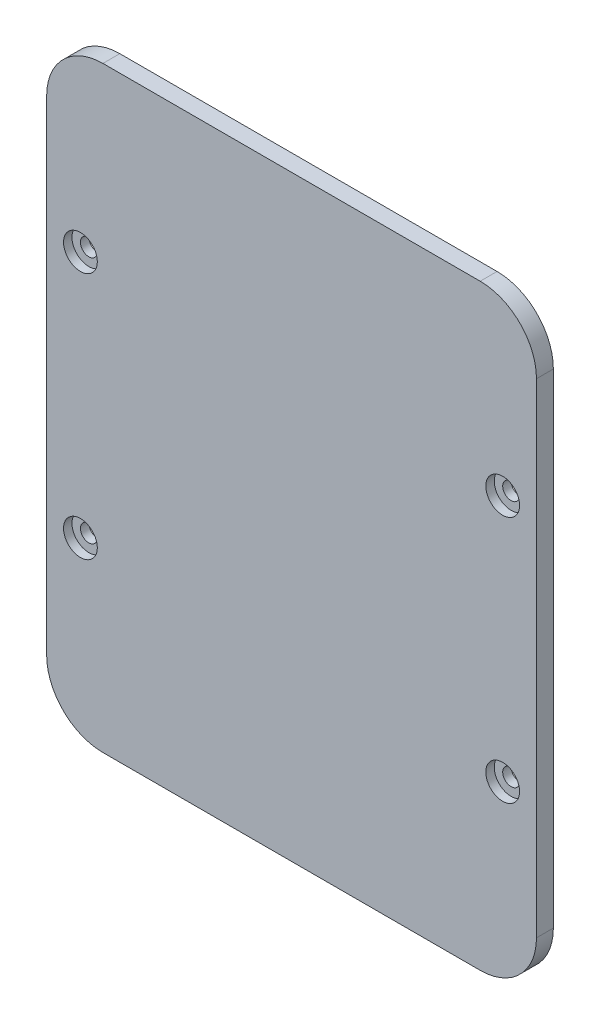
ISO-10303-21;
HEADER;
FILE_DESCRIPTION(('STEP AP214'),'2;1');
FILE_NAME('part.step','',(''),(''),'','','');
FILE_SCHEMA(('AUTOMOTIVE_DESIGN { 1 0 10303 214 1 1 1 1 }'));
ENDSEC;
DATA;
#1=APPLICATION_CONTEXT('core data for automotive mechanical design processes');
#2=APPLICATION_PROTOCOL_DEFINITION('international standard','automotive_design',2000,#1);
#3=PRODUCT_CONTEXT('',#1,'mechanical');
#4=PRODUCT('Part','Part','',(#3));
#5=PRODUCT_RELATED_PRODUCT_CATEGORY('part','',(#4));
#6=PRODUCT_DEFINITION_FORMATION('','',#4);
#7=PRODUCT_DEFINITION_CONTEXT('part definition',#1,'design');
#8=PRODUCT_DEFINITION('design','',#6,#7);
#9=PRODUCT_DEFINITION_SHAPE('','',#8);
#10=(LENGTH_UNIT() NAMED_UNIT(*) SI_UNIT(.MILLI.,.METRE.));
#11=(NAMED_UNIT(*) PLANE_ANGLE_UNIT() SI_UNIT($,.RADIAN.));
#12=(NAMED_UNIT(*) SI_UNIT($,.STERADIAN.) SOLID_ANGLE_UNIT());
#13=UNCERTAINTY_MEASURE_WITH_UNIT(LENGTH_MEASURE(1.E-05),#10,'distance_accuracy_value','');
#14=(GEOMETRIC_REPRESENTATION_CONTEXT(3) GLOBAL_UNCERTAINTY_ASSIGNED_CONTEXT((#13)) GLOBAL_UNIT_ASSIGNED_CONTEXT((#10,
#11,#12)) REPRESENTATION_CONTEXT('',''));
#15=CARTESIAN_POINT('',(0.,0.,0.));
#16=DIRECTION('',(0.,0.,1.));
#17=DIRECTION('',(1.,0.,0.));
#18=AXIS2_PLACEMENT_3D('',#15,#16,#17);
#19=CARTESIAN_POINT('',(75.,-50.,28.));
#20=DIRECTION('',(0.,0.,1.));
#21=DIRECTION('',(1.,0.,0.));
#22=AXIS2_PLACEMENT_3D('',#19,#20,#21);
#23=CYLINDRICAL_SURFACE('',#22,1.5);
#24=CARTESIAN_POINT('',(75.,-50.,38.));
#25=DIRECTION('',(0.,0.,1.));
#26=DIRECTION('',(1.,0.,0.));
#27=AXIS2_PLACEMENT_3D('',#24,#25,#26);
#28=CIRCLE('',#27,1.5);
#29=CARTESIAN_POINT('',(76.5,-50.,38.));
#30=VERTEX_POINT('',#29);
#31=EDGE_CURVE('E179',#30,#30,#28,.F.);
#32=ORIENTED_EDGE('',*,*,#31,.T.);
#33=EDGE_LOOP('',(#32));
#34=FACE_BOUND('',#33,.T.);
#35=CARTESIAN_POINT('',(75.,-50.,39.5));
#36=DIRECTION('',(0.,0.,1.));
#37=DIRECTION('',(1.,0.,0.));
#38=AXIS2_PLACEMENT_3D('',#35,#36,#37);
#39=CIRCLE('',#38,1.5);
#40=CARTESIAN_POINT('',(76.5,-50.,39.5));
#41=VERTEX_POINT('',#40);
#42=EDGE_CURVE('E180',#41,#41,#39,.F.);
#43=ORIENTED_EDGE('',*,*,#42,.F.);
#44=EDGE_LOOP('',(#43));
#45=FACE_BOUND('',#44,.T.);
#46=ADVANCED_FACE('F34',(#34,#45),#23,.F.);
#47=CARTESIAN_POINT('',(0.,-6.,28.));
#48=DIRECTION('',(0.,0.,1.));
#49=DIRECTION('',(1.,0.,0.));
#50=AXIS2_PLACEMENT_3D('',#47,#48,#49);
#51=CYLINDRICAL_SURFACE('',#50,1.5);
#52=CARTESIAN_POINT('',(0.,-6.,38.));
#53=DIRECTION('',(0.,0.,1.));
#54=DIRECTION('',(1.,0.,0.));
#55=AXIS2_PLACEMENT_3D('',#52,#53,#54);
#56=CIRCLE('',#55,1.5);
#57=CARTESIAN_POINT('',(1.5,-6.,38.));
#58=VERTEX_POINT('',#57);
#59=EDGE_CURVE('E119',#58,#58,#56,.F.);
#60=ORIENTED_EDGE('',*,*,#59,.T.);
#61=EDGE_LOOP('',(#60));
#62=FACE_BOUND('',#61,.T.);
#63=CARTESIAN_POINT('',(0.,-6.,39.5));
#64=DIRECTION('',(0.,0.,1.));
#65=DIRECTION('',(1.,0.,0.));
#66=AXIS2_PLACEMENT_3D('',#63,#64,#65);
#67=CIRCLE('',#66,1.5);
#68=CARTESIAN_POINT('',(1.5,-6.,39.5));
#69=VERTEX_POINT('',#68);
#70=EDGE_CURVE('E188',#69,#69,#67,.F.);
#71=ORIENTED_EDGE('',*,*,#70,.F.);
#72=EDGE_LOOP('',(#71));
#73=FACE_BOUND('',#72,.T.);
#74=ADVANCED_FACE('F196',(#62,#73),#51,.F.);
#75=CARTESIAN_POINT('',(0.,-50.,28.));
#76=DIRECTION('',(0.,0.,1.));
#77=DIRECTION('',(1.,0.,0.));
#78=AXIS2_PLACEMENT_3D('',#75,#76,#77);
#79=CYLINDRICAL_SURFACE('',#78,1.5);
#80=CARTESIAN_POINT('',(0.,-50.,38.));
#81=DIRECTION('',(0.,0.,1.));
#82=DIRECTION('',(1.,0.,0.));
#83=AXIS2_PLACEMENT_3D('',#80,#81,#82);
#84=CIRCLE('',#83,1.5);
#85=CARTESIAN_POINT('',(1.5,-50.,38.));
#86=VERTEX_POINT('',#85);
#87=EDGE_CURVE('E241',#86,#86,#84,.F.);
#88=ORIENTED_EDGE('',*,*,#87,.T.);
#89=EDGE_LOOP('',(#88));
#90=FACE_BOUND('',#89,.T.);
#91=CARTESIAN_POINT('',(0.,-50.,39.5));
#92=DIRECTION('',(0.,0.,1.));
#93=DIRECTION('',(1.,0.,0.));
#94=AXIS2_PLACEMENT_3D('',#91,#92,#93);
#95=CIRCLE('',#94,1.5);
#96=CARTESIAN_POINT('',(1.5,-50.,39.5));
#97=VERTEX_POINT('',#96);
#98=EDGE_CURVE('E184',#97,#97,#95,.F.);
#99=ORIENTED_EDGE('',*,*,#98,.F.);
#100=EDGE_LOOP('',(#99));
#101=FACE_BOUND('',#100,.T.);
#102=ADVANCED_FACE('F202',(#90,#101),#79,.F.);
#103=CARTESIAN_POINT('',(75.,-6.,28.));
#104=DIRECTION('',(0.,0.,1.));
#105=DIRECTION('',(1.,0.,0.));
#106=AXIS2_PLACEMENT_3D('',#103,#104,#105);
#107=CYLINDRICAL_SURFACE('',#106,1.5);
#108=CARTESIAN_POINT('',(75.,-6.,38.));
#109=DIRECTION('',(0.,0.,1.));
#110=DIRECTION('',(1.,0.,0.));
#111=AXIS2_PLACEMENT_3D('',#108,#109,#110);
#112=CIRCLE('',#111,1.5);
#113=CARTESIAN_POINT('',(76.5,-6.,38.));
#114=VERTEX_POINT('',#113);
#115=EDGE_CURVE('E176',#114,#114,#112,.F.);
#116=ORIENTED_EDGE('',*,*,#115,.T.);
#117=EDGE_LOOP('',(#116));
#118=FACE_BOUND('',#117,.T.);
#119=CARTESIAN_POINT('',(75.,-6.,39.5));
#120=DIRECTION('',(0.,0.,1.));
#121=DIRECTION('',(1.,0.,0.));
#122=AXIS2_PLACEMENT_3D('',#119,#120,#121);
#123=CIRCLE('',#122,1.5);
#124=CARTESIAN_POINT('',(76.5,-6.,39.5));
#125=VERTEX_POINT('',#124);
#126=EDGE_CURVE('E181',#125,#125,#123,.F.);
#127=ORIENTED_EDGE('',*,*,#126,.F.);
#128=EDGE_LOOP('',(#127));
#129=FACE_BOUND('',#128,.T.);
#130=ADVANCED_FACE('F208',(#118,#129),#107,.F.);
#131=CARTESIAN_POINT('',(81.,-81.,0.));
#132=DIRECTION('',(1.,0.,0.));
#133=DIRECTION('',(0.,0.,-1.));
#134=AXIS2_PLACEMENT_3D('',#131,#132,#133);
#135=PLANE('',#134);
#136=DIRECTION('',(0.,-1.,0.));
#137=VECTOR('',#136,1.);
#138=CARTESIAN_POINT('',(81.,-81.,38.));
#139=LINE('',#138,#137);
#140=CARTESIAN_POINT('',(81.,15.,38.));
#141=VERTEX_POINT('',#140);
#142=CARTESIAN_POINT('',(81.,-71.,38.));
#143=VERTEX_POINT('',#142);
#144=EDGE_CURVE('E104',#141,#143,#139,.T.);
#145=ORIENTED_EDGE('',*,*,#144,.F.);
#146=DIRECTION('',(0.,0.,1.));
#147=VECTOR('',#146,1.);
#148=CARTESIAN_POINT('',(81.,15.,0.));
#149=LINE('',#148,#147);
#150=CARTESIAN_POINT('',(81.,15.,41.));
#151=VERTEX_POINT('',#150);
#152=EDGE_CURVE('E115',#141,#151,#149,.T.);
#153=ORIENTED_EDGE('',*,*,#152,.T.);
#154=DIRECTION('',(0.,1.,0.));
#155=VECTOR('',#154,1.);
#156=CARTESIAN_POINT('',(81.,-81.,41.));
#157=LINE('',#156,#155);
#158=CARTESIAN_POINT('',(81.,-71.,41.));
#159=VERTEX_POINT('',#158);
#160=EDGE_CURVE('E170',#159,#151,#157,.T.);
#161=ORIENTED_EDGE('',*,*,#160,.F.);
#162=DIRECTION('',(0.,0.,1.));
#163=VECTOR('',#162,1.);
#164=CARTESIAN_POINT('',(81.,-71.,0.));
#165=LINE('',#164,#163);
#166=EDGE_CURVE('E118',#159,#143,#165,.F.);
#167=ORIENTED_EDGE('',*,*,#166,.T.);
#168=EDGE_LOOP('',(#145,#153,#161,#167));
#169=FACE_BOUND('',#168,.T.);
#170=ADVANCED_FACE('F113',(#169),#135,.T.);
#171=CARTESIAN_POINT('',(-6.,25.,0.));
#172=DIRECTION('',(0.,1.,0.));
#173=DIRECTION('',(-1.,0.,0.));
#174=AXIS2_PLACEMENT_3D('',#171,#172,#173);
#175=PLANE('',#174);
#176=DIRECTION('',(-1.,0.,0.));
#177=VECTOR('',#176,1.);
#178=CARTESIAN_POINT('',(-6.,25.,41.));
#179=LINE('',#178,#177);
#180=CARTESIAN_POINT('',(71.,25.,41.));
#181=VERTEX_POINT('',#180);
#182=CARTESIAN_POINT('',(4.,25.,41.));
#183=VERTEX_POINT('',#182);
#184=EDGE_CURVE('E127',#181,#183,#179,.T.);
#185=ORIENTED_EDGE('',*,*,#184,.F.);
#186=DIRECTION('',(0.,0.,1.));
#187=VECTOR('',#186,1.);
#188=CARTESIAN_POINT('',(71.,25.,0.));
#189=LINE('',#188,#187);
#190=CARTESIAN_POINT('',(71.,25.,38.));
#191=VERTEX_POINT('',#190);
#192=EDGE_CURVE('E138',#181,#191,#189,.F.);
#193=ORIENTED_EDGE('',*,*,#192,.T.);
#194=DIRECTION('',(1.,0.,0.));
#195=VECTOR('',#194,1.);
#196=CARTESIAN_POINT('',(-6.,25.,38.));
#197=LINE('',#196,#195);
#198=CARTESIAN_POINT('',(4.,25.,38.));
#199=VERTEX_POINT('',#198);
#200=EDGE_CURVE('E106',#199,#191,#197,.T.);
#201=ORIENTED_EDGE('',*,*,#200,.F.);
#202=DIRECTION('',(0.,0.,1.));
#203=VECTOR('',#202,1.);
#204=CARTESIAN_POINT('',(4.,25.,0.));
#205=LINE('',#204,#203);
#206=EDGE_CURVE('E135',#199,#183,#205,.T.);
#207=ORIENTED_EDGE('',*,*,#206,.T.);
#208=EDGE_LOOP('',(#185,#193,#201,#207));
#209=FACE_BOUND('',#208,.T.);
#210=ADVANCED_FACE('F167',(#209),#175,.T.);
#211=CARTESIAN_POINT('',(-6.,-81.,0.));
#212=DIRECTION('',(0.,-1.,0.));
#213=DIRECTION('',(0.,0.,-1.));
#214=AXIS2_PLACEMENT_3D('',#211,#212,#213);
#215=PLANE('',#214);
#216=DIRECTION('',(-1.,0.,0.));
#217=VECTOR('',#216,1.);
#218=CARTESIAN_POINT('',(-6.,-81.,38.));
#219=LINE('',#218,#217);
#220=CARTESIAN_POINT('',(71.,-81.,38.));
#221=VERTEX_POINT('',#220);
#222=CARTESIAN_POINT('',(4.,-81.,38.));
#223=VERTEX_POINT('',#222);
#224=EDGE_CURVE('E161',#221,#223,#219,.T.);
#225=ORIENTED_EDGE('',*,*,#224,.F.);
#226=DIRECTION('',(0.,0.,1.));
#227=VECTOR('',#226,1.);
#228=CARTESIAN_POINT('',(71.,-81.,0.));
#229=LINE('',#228,#227);
#230=CARTESIAN_POINT('',(71.,-81.,41.));
#231=VERTEX_POINT('',#230);
#232=EDGE_CURVE('E146',#221,#231,#229,.T.);
#233=ORIENTED_EDGE('',*,*,#232,.T.);
#234=DIRECTION('',(1.,0.,0.));
#235=VECTOR('',#234,1.);
#236=CARTESIAN_POINT('',(-6.,-81.,41.));
#237=LINE('',#236,#235);
#238=CARTESIAN_POINT('',(4.,-81.,41.));
#239=VERTEX_POINT('',#238);
#240=EDGE_CURVE('E172',#239,#231,#237,.T.);
#241=ORIENTED_EDGE('',*,*,#240,.F.);
#242=DIRECTION('',(0.,0.,1.));
#243=VECTOR('',#242,1.);
#244=CARTESIAN_POINT('',(4.,-81.,0.));
#245=LINE('',#244,#243);
#246=EDGE_CURVE('E49',#239,#223,#245,.F.);
#247=ORIENTED_EDGE('',*,*,#246,.T.);
#248=EDGE_LOOP('',(#225,#233,#241,#247));
#249=FACE_BOUND('',#248,.T.);
#250=ADVANCED_FACE('F215',(#249),#215,.T.);
#251=CARTESIAN_POINT('',(-6.,-81.,0.));
#252=DIRECTION('',(-1.,0.,0.));
#253=DIRECTION('',(0.,0.,1.));
#254=AXIS2_PLACEMENT_3D('',#251,#252,#253);
#255=PLANE('',#254);
#256=DIRECTION('',(0.,1.,0.));
#257=VECTOR('',#256,1.);
#258=CARTESIAN_POINT('',(-6.,-81.,38.));
#259=LINE('',#258,#257);
#260=CARTESIAN_POINT('',(-6.,-71.,38.));
#261=VERTEX_POINT('',#260);
#262=CARTESIAN_POINT('',(-6.,15.,38.));
#263=VERTEX_POINT('',#262);
#264=EDGE_CURVE('E154',#261,#263,#259,.T.);
#265=ORIENTED_EDGE('',*,*,#264,.F.);
#266=DIRECTION('',(0.,0.,1.));
#267=VECTOR('',#266,1.);
#268=CARTESIAN_POINT('',(-6.,-71.,0.));
#269=LINE('',#268,#267);
#270=CARTESIAN_POINT('',(-6.,-71.,41.));
#271=VERTEX_POINT('',#270);
#272=EDGE_CURVE('E11',#261,#271,#269,.T.);
#273=ORIENTED_EDGE('',*,*,#272,.T.);
#274=DIRECTION('',(0.,-1.,0.));
#275=VECTOR('',#274,1.);
#276=CARTESIAN_POINT('',(-6.,-81.,41.));
#277=LINE('',#276,#275);
#278=CARTESIAN_POINT('',(-6.,15.,41.));
#279=VERTEX_POINT('',#278);
#280=EDGE_CURVE('E157',#279,#271,#277,.T.);
#281=ORIENTED_EDGE('',*,*,#280,.F.);
#282=DIRECTION('',(0.,0.,1.));
#283=VECTOR('',#282,1.);
#284=CARTESIAN_POINT('',(-6.,15.,0.));
#285=LINE('',#284,#283);
#286=EDGE_CURVE('E42',#279,#263,#285,.F.);
#287=ORIENTED_EDGE('',*,*,#286,.T.);
#288=EDGE_LOOP('',(#265,#273,#281,#287));
#289=FACE_BOUND('',#288,.T.);
#290=ADVANCED_FACE('F153',(#289),#255,.T.);
#291=CARTESIAN_POINT('',(0.,0.,41.));
#292=DIRECTION('',(0.,0.,-1.));
#293=DIRECTION('',(-1.,0.,0.));
#294=AXIS2_PLACEMENT_3D('',#291,#292,#293);
#295=PLANE('',#294);
#296=CARTESIAN_POINT('',(75.,-50.,41.));
#297=DIRECTION('',(0.,0.,1.));
#298=DIRECTION('',(1.,0.,0.));
#299=AXIS2_PLACEMENT_3D('',#296,#297,#298);
#300=CIRCLE('',#299,3.00000000000001);
#301=CARTESIAN_POINT('',(78.,-50.,41.));
#302=VERTEX_POINT('',#301);
#303=EDGE_CURVE('E251',#302,#302,#300,.T.);
#304=ORIENTED_EDGE('',*,*,#303,.F.);
#305=EDGE_LOOP('',(#304));
#306=FACE_BOUND('',#305,.T.);
#307=CARTESIAN_POINT('',(75.,-6.,41.));
#308=DIRECTION('',(0.,0.,1.));
#309=DIRECTION('',(1.,0.,0.));
#310=AXIS2_PLACEMENT_3D('',#307,#308,#309);
#311=CIRCLE('',#310,3.00000000000001);
#312=CARTESIAN_POINT('',(78.,-6.,41.));
#313=VERTEX_POINT('',#312);
#314=EDGE_CURVE('E257',#313,#313,#311,.T.);
#315=ORIENTED_EDGE('',*,*,#314,.F.);
#316=EDGE_LOOP('',(#315));
#317=FACE_BOUND('',#316,.T.);
#318=CARTESIAN_POINT('',(0.,-6.,41.));
#319=DIRECTION('',(0.,0.,1.));
#320=DIRECTION('',(1.,0.,0.));
#321=AXIS2_PLACEMENT_3D('',#318,#319,#320);
#322=CIRCLE('',#321,3.);
#323=CARTESIAN_POINT('',(3.,-6.,41.));
#324=VERTEX_POINT('',#323);
#325=EDGE_CURVE('E263',#324,#324,#322,.T.);
#326=ORIENTED_EDGE('',*,*,#325,.F.);
#327=EDGE_LOOP('',(#326));
#328=FACE_BOUND('',#327,.T.);
#329=CARTESIAN_POINT('',(0.,-50.,41.));
#330=DIRECTION('',(0.,0.,1.));
#331=DIRECTION('',(1.,0.,0.));
#332=AXIS2_PLACEMENT_3D('',#329,#330,#331);
#333=CIRCLE('',#332,3.);
#334=CARTESIAN_POINT('',(3.,-50.,41.));
#335=VERTEX_POINT('',#334);
#336=EDGE_CURVE('E245',#335,#335,#333,.T.);
#337=ORIENTED_EDGE('',*,*,#336,.F.);
#338=EDGE_LOOP('',(#337));
#339=FACE_BOUND('',#338,.T.);
#340=ORIENTED_EDGE('',*,*,#160,.T.);
#341=CARTESIAN_POINT('',(71.,15.,41.));
#342=DIRECTION('',(0.,0.,-1.));
#343=DIRECTION('',(-1.,0.,0.));
#344=AXIS2_PLACEMENT_3D('',#341,#342,#343);
#345=CIRCLE('',#344,10.);
#346=EDGE_CURVE('E122',#151,#181,#345,.F.);
#347=ORIENTED_EDGE('',*,*,#346,.T.);
#348=ORIENTED_EDGE('',*,*,#184,.T.);
#349=CARTESIAN_POINT('',(4.,15.,41.));
#350=DIRECTION('',(0.,0.,-1.));
#351=DIRECTION('',(-1.,0.,0.));
#352=AXIS2_PLACEMENT_3D('',#349,#350,#351);
#353=CIRCLE('',#352,10.);
#354=EDGE_CURVE('E123',#183,#279,#353,.F.);
#355=ORIENTED_EDGE('',*,*,#354,.T.);
#356=ORIENTED_EDGE('',*,*,#280,.T.);
#357=CARTESIAN_POINT('',(4.,-71.,41.));
#358=DIRECTION('',(0.,0.,-1.));
#359=DIRECTION('',(-1.,0.,0.));
#360=AXIS2_PLACEMENT_3D('',#357,#358,#359);
#361=CIRCLE('',#360,10.);
#362=EDGE_CURVE('E125',#271,#239,#361,.F.);
#363=ORIENTED_EDGE('',*,*,#362,.T.);
#364=ORIENTED_EDGE('',*,*,#240,.T.);
#365=CARTESIAN_POINT('',(71.,-71.,41.));
#366=DIRECTION('',(0.,0.,-1.));
#367=DIRECTION('',(-1.,0.,0.));
#368=AXIS2_PLACEMENT_3D('',#365,#366,#367);
#369=CIRCLE('',#368,10.);
#370=EDGE_CURVE('E132',#231,#159,#369,.F.);
#371=ORIENTED_EDGE('',*,*,#370,.T.);
#372=EDGE_LOOP('',(#340,#347,#348,#355,#356,#363,#364,#371));
#373=FACE_BOUND('',#372,.T.);
#374=ADVANCED_FACE('F169',(#306,#317,#328,#339,#373),#295,.F.);
#375=CARTESIAN_POINT('',(0.,0.,38.));
#376=DIRECTION('',(0.,0.,-1.));
#377=DIRECTION('',(-1.,0.,0.));
#378=AXIS2_PLACEMENT_3D('',#375,#376,#377);
#379=PLANE('',#378);
#380=ORIENTED_EDGE('',*,*,#200,.T.);
#381=CARTESIAN_POINT('',(71.,15.,38.));
#382=DIRECTION('',(0.,0.,-1.));
#383=DIRECTION('',(-1.,0.,0.));
#384=AXIS2_PLACEMENT_3D('',#381,#382,#383);
#385=CIRCLE('',#384,10.);
#386=EDGE_CURVE('E100',#191,#141,#385,.T.);
#387=ORIENTED_EDGE('',*,*,#386,.T.);
#388=ORIENTED_EDGE('',*,*,#144,.T.);
#389=CARTESIAN_POINT('',(71.,-71.,38.));
#390=DIRECTION('',(0.,0.,-1.));
#391=DIRECTION('',(-1.,0.,0.));
#392=AXIS2_PLACEMENT_3D('',#389,#390,#391);
#393=CIRCLE('',#392,10.);
#394=EDGE_CURVE('E56',#143,#221,#393,.T.);
#395=ORIENTED_EDGE('',*,*,#394,.T.);
#396=ORIENTED_EDGE('',*,*,#224,.T.);
#397=CARTESIAN_POINT('',(4.,-71.,38.));
#398=DIRECTION('',(0.,0.,-1.));
#399=DIRECTION('',(-1.,0.,0.));
#400=AXIS2_PLACEMENT_3D('',#397,#398,#399);
#401=CIRCLE('',#400,10.);
#402=EDGE_CURVE('E142',#223,#261,#401,.T.);
#403=ORIENTED_EDGE('',*,*,#402,.T.);
#404=ORIENTED_EDGE('',*,*,#264,.T.);
#405=CARTESIAN_POINT('',(4.,15.,38.));
#406=DIRECTION('',(0.,0.,-1.));
#407=DIRECTION('',(-1.,0.,0.));
#408=AXIS2_PLACEMENT_3D('',#405,#406,#407);
#409=CIRCLE('',#408,10.);
#410=EDGE_CURVE('E140',#263,#199,#409,.T.);
#411=ORIENTED_EDGE('',*,*,#410,.T.);
#412=EDGE_LOOP('',(#380,#387,#388,#395,#396,#403,#404,#411));
#413=FACE_BOUND('',#412,.T.);
#414=ORIENTED_EDGE('',*,*,#87,.F.);
#415=EDGE_LOOP('',(#414));
#416=FACE_BOUND('',#415,.T.);
#417=ORIENTED_EDGE('',*,*,#115,.F.);
#418=EDGE_LOOP('',(#417));
#419=FACE_BOUND('',#418,.T.);
#420=ORIENTED_EDGE('',*,*,#31,.F.);
#421=EDGE_LOOP('',(#420));
#422=FACE_BOUND('',#421,.T.);
#423=ORIENTED_EDGE('',*,*,#59,.F.);
#424=EDGE_LOOP('',(#423));
#425=FACE_BOUND('',#424,.T.);
#426=ADVANCED_FACE('F102',(#413,#416,#419,#422,#425),#379,.T.);
#427=CARTESIAN_POINT('',(75.,-6.,39.5));
#428=DIRECTION('',(0.,0.,1.));
#429=DIRECTION('',(1.,0.,0.));
#430=AXIS2_PLACEMENT_3D('',#427,#428,#429);
#431=PLANE('',#430);
#432=CARTESIAN_POINT('',(75.,-6.,39.5));
#433=DIRECTION('',(0.,0.,1.));
#434=DIRECTION('',(1.,0.,0.));
#435=AXIS2_PLACEMENT_3D('',#432,#433,#434);
#436=CIRCLE('',#435,3.00000000000001);
#437=CARTESIAN_POINT('',(78.,-6.,39.5));
#438=VERTEX_POINT('',#437);
#439=EDGE_CURVE('E260',#438,#438,#436,.T.);
#440=ORIENTED_EDGE('',*,*,#439,.T.);
#441=EDGE_LOOP('',(#440));
#442=FACE_BOUND('',#441,.T.);
#443=ORIENTED_EDGE('',*,*,#126,.T.);
#444=EDGE_LOOP('',(#443));
#445=FACE_BOUND('',#444,.T.);
#446=ADVANCED_FACE('F300',(#442,#445),#431,.T.);
#447=CARTESIAN_POINT('',(75.,-6.,39.5));
#448=DIRECTION('',(0.,0.,1.));
#449=DIRECTION('',(1.,0.,0.));
#450=AXIS2_PLACEMENT_3D('',#447,#448,#449);
#451=CYLINDRICAL_SURFACE('',#450,3.00000000000001);
#452=ORIENTED_EDGE('',*,*,#439,.F.);
#453=EDGE_LOOP('',(#452));
#454=FACE_BOUND('',#453,.T.);
#455=ORIENTED_EDGE('',*,*,#314,.T.);
#456=EDGE_LOOP('',(#455));
#457=FACE_BOUND('',#456,.T.);
#458=ADVANCED_FACE('F294',(#454,#457),#451,.F.);
#459=CARTESIAN_POINT('',(0.,-50.,39.5));
#460=DIRECTION('',(0.,0.,1.));
#461=DIRECTION('',(1.,0.,0.));
#462=AXIS2_PLACEMENT_3D('',#459,#460,#461);
#463=PLANE('',#462);
#464=CARTESIAN_POINT('',(0.,-50.,39.5));
#465=DIRECTION('',(0.,0.,1.));
#466=DIRECTION('',(1.,0.,0.));
#467=AXIS2_PLACEMENT_3D('',#464,#465,#466);
#468=CIRCLE('',#467,3.);
#469=CARTESIAN_POINT('',(3.,-50.,39.5));
#470=VERTEX_POINT('',#469);
#471=EDGE_CURVE('E185',#470,#470,#468,.T.);
#472=ORIENTED_EDGE('',*,*,#471,.T.);
#473=EDGE_LOOP('',(#472));
#474=FACE_BOUND('',#473,.T.);
#475=ORIENTED_EDGE('',*,*,#98,.T.);
#476=EDGE_LOOP('',(#475));
#477=FACE_BOUND('',#476,.T.);
#478=ADVANCED_FACE('F286',(#474,#477),#463,.T.);
#479=CARTESIAN_POINT('',(0.,-50.,39.5));
#480=DIRECTION('',(0.,0.,1.));
#481=DIRECTION('',(1.,0.,0.));
#482=AXIS2_PLACEMENT_3D('',#479,#480,#481);
#483=CYLINDRICAL_SURFACE('',#482,3.);
#484=ORIENTED_EDGE('',*,*,#471,.F.);
#485=EDGE_LOOP('',(#484));
#486=FACE_BOUND('',#485,.T.);
#487=ORIENTED_EDGE('',*,*,#336,.T.);
#488=EDGE_LOOP('',(#487));
#489=FACE_BOUND('',#488,.T.);
#490=ADVANCED_FACE('F284',(#486,#489),#483,.F.);
#491=CARTESIAN_POINT('',(0.,-6.,39.5));
#492=DIRECTION('',(0.,0.,1.));
#493=DIRECTION('',(1.,0.,0.));
#494=AXIS2_PLACEMENT_3D('',#491,#492,#493);
#495=PLANE('',#494);
#496=CARTESIAN_POINT('',(0.,-6.,39.5));
#497=DIRECTION('',(0.,0.,1.));
#498=DIRECTION('',(1.,0.,0.));
#499=AXIS2_PLACEMENT_3D('',#496,#497,#498);
#500=CIRCLE('',#499,3.);
#501=CARTESIAN_POINT('',(3.,-6.,39.5));
#502=VERTEX_POINT('',#501);
#503=EDGE_CURVE('E248',#502,#502,#500,.T.);
#504=ORIENTED_EDGE('',*,*,#503,.T.);
#505=EDGE_LOOP('',(#504));
#506=FACE_BOUND('',#505,.T.);
#507=ORIENTED_EDGE('',*,*,#70,.T.);
#508=EDGE_LOOP('',(#507));
#509=FACE_BOUND('',#508,.T.);
#510=ADVANCED_FACE('F269',(#506,#509),#495,.T.);
#511=CARTESIAN_POINT('',(0.,-6.,39.5));
#512=DIRECTION('',(0.,0.,1.));
#513=DIRECTION('',(1.,0.,0.));
#514=AXIS2_PLACEMENT_3D('',#511,#512,#513);
#515=CYLINDRICAL_SURFACE('',#514,3.);
#516=ORIENTED_EDGE('',*,*,#503,.F.);
#517=EDGE_LOOP('',(#516));
#518=FACE_BOUND('',#517,.T.);
#519=ORIENTED_EDGE('',*,*,#325,.T.);
#520=EDGE_LOOP('',(#519));
#521=FACE_BOUND('',#520,.T.);
#522=ADVANCED_FACE('F272',(#518,#521),#515,.F.);
#523=CARTESIAN_POINT('',(75.,-50.,39.5));
#524=DIRECTION('',(0.,0.,1.));
#525=DIRECTION('',(1.,0.,0.));
#526=AXIS2_PLACEMENT_3D('',#523,#524,#525);
#527=PLANE('',#526);
#528=CARTESIAN_POINT('',(75.,-50.,39.5));
#529=DIRECTION('',(0.,0.,1.));
#530=DIRECTION('',(1.,0.,0.));
#531=AXIS2_PLACEMENT_3D('',#528,#529,#530);
#532=CIRCLE('',#531,3.00000000000001);
#533=CARTESIAN_POINT('',(78.,-50.,39.5));
#534=VERTEX_POINT('',#533);
#535=EDGE_CURVE('E254',#534,#534,#532,.T.);
#536=ORIENTED_EDGE('',*,*,#535,.T.);
#537=EDGE_LOOP('',(#536));
#538=FACE_BOUND('',#537,.T.);
#539=ORIENTED_EDGE('',*,*,#42,.T.);
#540=EDGE_LOOP('',(#539));
#541=FACE_BOUND('',#540,.T.);
#542=ADVANCED_FACE('F193',(#538,#541),#527,.T.);
#543=CARTESIAN_POINT('',(75.,-50.,39.5));
#544=DIRECTION('',(0.,0.,1.));
#545=DIRECTION('',(1.,0.,0.));
#546=AXIS2_PLACEMENT_3D('',#543,#544,#545);
#547=CYLINDRICAL_SURFACE('',#546,3.00000000000001);
#548=ORIENTED_EDGE('',*,*,#535,.F.);
#549=EDGE_LOOP('',(#548));
#550=FACE_BOUND('',#549,.T.);
#551=ORIENTED_EDGE('',*,*,#303,.T.);
#552=EDGE_LOOP('',(#551));
#553=FACE_BOUND('',#552,.T.);
#554=ADVANCED_FACE('F225',(#550,#553),#547,.F.);
#555=CARTESIAN_POINT('',(71.,15.,0.));
#556=DIRECTION('',(0.,0.,1.));
#557=DIRECTION('',(1.,0.,0.));
#558=AXIS2_PLACEMENT_3D('',#555,#556,#557);
#559=CYLINDRICAL_SURFACE('',#558,10.);
#560=ORIENTED_EDGE('',*,*,#386,.F.);
#561=ORIENTED_EDGE('',*,*,#192,.F.);
#562=ORIENTED_EDGE('',*,*,#346,.F.);
#563=ORIENTED_EDGE('',*,*,#152,.F.);
#564=EDGE_LOOP('',(#560,#561,#562,#563));
#565=FACE_BOUND('',#564,.T.);
#566=ADVANCED_FACE('F121',(#565),#559,.T.);
#567=CARTESIAN_POINT('',(71.,-71.,0.));
#568=DIRECTION('',(0.,0.,1.));
#569=DIRECTION('',(1.,0.,0.));
#570=AXIS2_PLACEMENT_3D('',#567,#568,#569);
#571=CYLINDRICAL_SURFACE('',#570,10.);
#572=ORIENTED_EDGE('',*,*,#394,.F.);
#573=ORIENTED_EDGE('',*,*,#166,.F.);
#574=ORIENTED_EDGE('',*,*,#370,.F.);
#575=ORIENTED_EDGE('',*,*,#232,.F.);
#576=EDGE_LOOP('',(#572,#573,#574,#575));
#577=FACE_BOUND('',#576,.T.);
#578=ADVANCED_FACE('F224',(#577),#571,.T.);
#579=CARTESIAN_POINT('',(4.,-71.,0.));
#580=DIRECTION('',(0.,0.,1.));
#581=DIRECTION('',(1.,0.,0.));
#582=AXIS2_PLACEMENT_3D('',#579,#580,#581);
#583=CYLINDRICAL_SURFACE('',#582,10.);
#584=ORIENTED_EDGE('',*,*,#402,.F.);
#585=ORIENTED_EDGE('',*,*,#246,.F.);
#586=ORIENTED_EDGE('',*,*,#362,.F.);
#587=ORIENTED_EDGE('',*,*,#272,.F.);
#588=EDGE_LOOP('',(#584,#585,#586,#587));
#589=FACE_BOUND('',#588,.T.);
#590=ADVANCED_FACE('F227',(#589),#583,.T.);
#591=CARTESIAN_POINT('',(4.,15.,0.));
#592=DIRECTION('',(0.,0.,1.));
#593=DIRECTION('',(1.,0.,0.));
#594=AXIS2_PLACEMENT_3D('',#591,#592,#593);
#595=CYLINDRICAL_SURFACE('',#594,10.);
#596=ORIENTED_EDGE('',*,*,#410,.F.);
#597=ORIENTED_EDGE('',*,*,#286,.F.);
#598=ORIENTED_EDGE('',*,*,#354,.F.);
#599=ORIENTED_EDGE('',*,*,#206,.F.);
#600=EDGE_LOOP('',(#596,#597,#598,#599));
#601=FACE_BOUND('',#600,.T.);
#602=ADVANCED_FACE('F36',(#601),#595,.T.);
#603=CLOSED_SHELL('',(#46,#74,#102,#130,#170,#210,#250,#290,#374,#426,#446,#458,#478,#490,#510,
#522,#542,#554,#566,#578,#590,#602));
#604=MANIFOLD_SOLID_BREP('B2',#603);
#605=ADVANCED_BREP_SHAPE_REPRESENTATION('',(#18,#604),#14);
#606=SHAPE_DEFINITION_REPRESENTATION(#9,#605);
ENDSEC;
END-ISO-10303-21;
